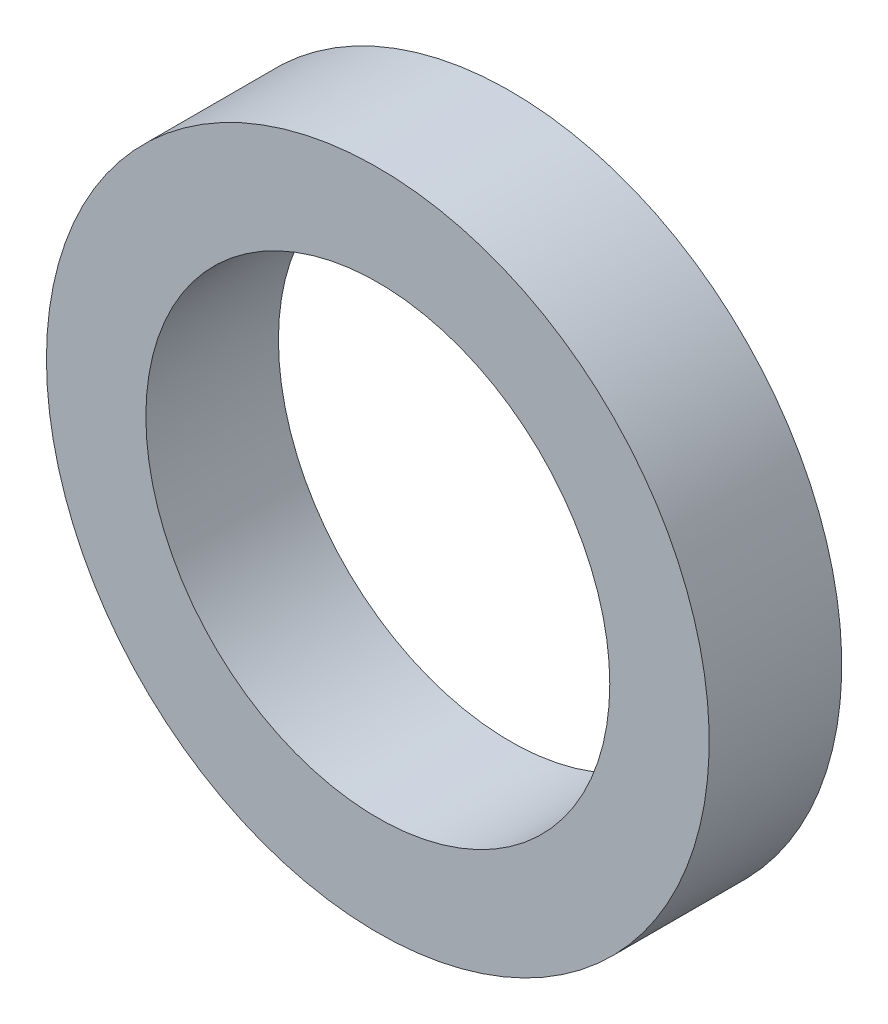
ISO-10303-21;
HEADER;
FILE_DESCRIPTION(('STEP AP214'),'2;1');
FILE_NAME('part.step','',(''),(''),'','','');
FILE_SCHEMA(('AUTOMOTIVE_DESIGN { 1 0 10303 214 1 1 1 1 }'));
ENDSEC;
DATA;
#1=APPLICATION_CONTEXT('core data for automotive mechanical design processes');
#2=APPLICATION_PROTOCOL_DEFINITION('international standard','automotive_design',2000,#1);
#3=PRODUCT_CONTEXT('',#1,'mechanical');
#4=PRODUCT('Part','Part','',(#3));
#5=PRODUCT_RELATED_PRODUCT_CATEGORY('part','',(#4));
#6=PRODUCT_DEFINITION_FORMATION('','',#4);
#7=PRODUCT_DEFINITION_CONTEXT('part definition',#1,'design');
#8=PRODUCT_DEFINITION('design','',#6,#7);
#9=PRODUCT_DEFINITION_SHAPE('','',#8);
#10=(LENGTH_UNIT() NAMED_UNIT(*) SI_UNIT(.MILLI.,.METRE.));
#11=(NAMED_UNIT(*) PLANE_ANGLE_UNIT() SI_UNIT($,.RADIAN.));
#12=(NAMED_UNIT(*) SI_UNIT($,.STERADIAN.) SOLID_ANGLE_UNIT());
#13=UNCERTAINTY_MEASURE_WITH_UNIT(LENGTH_MEASURE(1.E-05),#10,'distance_accuracy_value','');
#14=(GEOMETRIC_REPRESENTATION_CONTEXT(3) GLOBAL_UNCERTAINTY_ASSIGNED_CONTEXT((#13)) GLOBAL_UNIT_ASSIGNED_CONTEXT((#10,
#11,#12)) REPRESENTATION_CONTEXT('',''));
#15=CARTESIAN_POINT('',(0.,0.,0.));
#16=DIRECTION('',(0.,0.,1.));
#17=DIRECTION('',(1.,0.,0.));
#18=AXIS2_PLACEMENT_3D('',#15,#16,#17);
#19=CARTESIAN_POINT('',(0.,0.,1.5875));
#20=DIRECTION('',(0.,0.,1.));
#21=DIRECTION('',(1.,0.,0.));
#22=AXIS2_PLACEMENT_3D('',#19,#20,#21);
#23=PLANE('',#22);
#24=CARTESIAN_POINT('',(0.,0.,1.5875));
#25=DIRECTION('',(0.,0.,-1.));
#26=DIRECTION('',(-1.,0.,0.));
#27=AXIS2_PLACEMENT_3D('',#24,#25,#26);
#28=CIRCLE('',#27,5.55625);
#29=CARTESIAN_POINT('',(-5.55625,0.,1.5875));
#30=VERTEX_POINT('',#29);
#31=EDGE_CURVE('E27',#30,#30,#28,.T.);
#32=ORIENTED_EDGE('',*,*,#31,.T.);
#33=EDGE_LOOP('',(#32));
#34=FACE_BOUND('',#33,.T.);
#35=CARTESIAN_POINT('',(0.,0.,1.5875));
#36=DIRECTION('',(0.,0.,-1.));
#37=DIRECTION('',(-1.,0.,0.));
#38=AXIS2_PLACEMENT_3D('',#35,#36,#37);
#39=CIRCLE('',#38,7.9375);
#40=CARTESIAN_POINT('',(-7.9375,0.,1.5875));
#41=VERTEX_POINT('',#40);
#42=EDGE_CURVE('E18',#41,#41,#39,.T.);
#43=ORIENTED_EDGE('',*,*,#42,.F.);
#44=EDGE_LOOP('',(#43));
#45=FACE_BOUND('',#44,.T.);
#46=ADVANCED_FACE('F15',(#34,#45),#23,.T.);
#47=CARTESIAN_POINT('',(0.,0.,1.5875));
#48=DIRECTION('',(0.,0.,-1.));
#49=DIRECTION('',(-1.,0.,0.));
#50=AXIS2_PLACEMENT_3D('',#47,#48,#49);
#51=CYLINDRICAL_SURFACE('',#50,7.9375);
#52=ORIENTED_EDGE('',*,*,#42,.T.);
#53=EDGE_LOOP('',(#52));
#54=FACE_BOUND('',#53,.T.);
#55=CARTESIAN_POINT('',(0.,0.,-1.58750000075));
#56=DIRECTION('',(0.,0.,-1.));
#57=DIRECTION('',(-1.,0.,0.));
#58=AXIS2_PLACEMENT_3D('',#55,#56,#57);
#59=CIRCLE('',#58,7.9375);
#60=CARTESIAN_POINT('',(-7.9375,0.,-1.58750000075));
#61=VERTEX_POINT('',#60);
#62=EDGE_CURVE('E22',#61,#61,#59,.F.);
#63=ORIENTED_EDGE('',*,*,#62,.T.);
#64=EDGE_LOOP('',(#63));
#65=FACE_BOUND('',#64,.T.);
#66=ADVANCED_FACE('F35',(#54,#65),#51,.T.);
#67=CARTESIAN_POINT('',(0.,0.,1.5875));
#68=DIRECTION('',(0.,0.,-1.));
#69=DIRECTION('',(-1.,0.,0.));
#70=AXIS2_PLACEMENT_3D('',#67,#68,#69);
#71=CYLINDRICAL_SURFACE('',#70,5.55625);
#72=CARTESIAN_POINT('',(0.,0.,-1.58750000075));
#73=DIRECTION('',(0.,0.,-1.));
#74=DIRECTION('',(-1.,0.,0.));
#75=AXIS2_PLACEMENT_3D('',#72,#73,#74);
#76=CIRCLE('',#75,5.55625);
#77=CARTESIAN_POINT('',(-5.55625,0.,-1.58750000075));
#78=VERTEX_POINT('',#77);
#79=EDGE_CURVE('E10',#78,#78,#76,.T.);
#80=ORIENTED_EDGE('',*,*,#79,.T.);
#81=EDGE_LOOP('',(#80));
#82=FACE_BOUND('',#81,.T.);
#83=ORIENTED_EDGE('',*,*,#31,.F.);
#84=EDGE_LOOP('',(#83));
#85=FACE_BOUND('',#84,.T.);
#86=ADVANCED_FACE('F43',(#82,#85),#71,.F.);
#87=CARTESIAN_POINT('',(0.,0.,-1.5875));
#88=DIRECTION('',(0.,0.,1.));
#89=DIRECTION('',(1.,0.,0.));
#90=AXIS2_PLACEMENT_3D('',#87,#88,#89);
#91=PLANE('',#90);
#92=ORIENTED_EDGE('',*,*,#79,.F.);
#93=EDGE_LOOP('',(#92));
#94=FACE_BOUND('',#93,.T.);
#95=ORIENTED_EDGE('',*,*,#62,.F.);
#96=EDGE_LOOP('',(#95));
#97=FACE_BOUND('',#96,.T.);
#98=ADVANCED_FACE('F44',(#94,#97),#91,.F.);
#99=CLOSED_SHELL('',(#46,#66,#86,#98));
#100=MANIFOLD_SOLID_BREP('B1',#99);
#101=ADVANCED_BREP_SHAPE_REPRESENTATION('',(#18,#100),#14);
#102=SHAPE_DEFINITION_REPRESENTATION(#9,#101);
ENDSEC;
END-ISO-10303-21;
